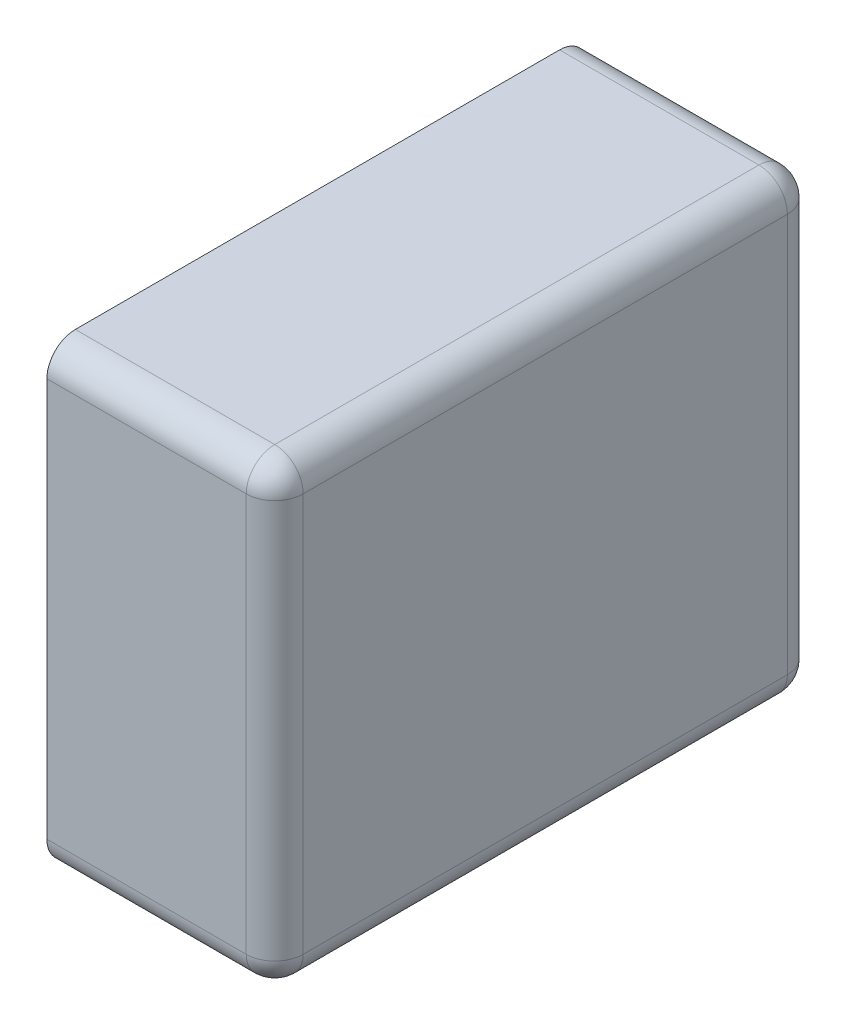
ISO-10303-21;
HEADER;
FILE_DESCRIPTION(('STEP AP214'),'2;1');
FILE_NAME('part.step','',(''),(''),'','','');
FILE_SCHEMA(('AUTOMOTIVE_DESIGN { 1 0 10303 214 1 1 1 1 }'));
ENDSEC;
DATA;
#1=APPLICATION_CONTEXT('core data for automotive mechanical design processes');
#2=APPLICATION_PROTOCOL_DEFINITION('international standard','automotive_design',2000,#1);
#3=PRODUCT_CONTEXT('',#1,'mechanical');
#4=PRODUCT('Part','Part','',(#3));
#5=PRODUCT_RELATED_PRODUCT_CATEGORY('part','',(#4));
#6=PRODUCT_DEFINITION_FORMATION('','',#4);
#7=PRODUCT_DEFINITION_CONTEXT('part definition',#1,'design');
#8=PRODUCT_DEFINITION('design','',#6,#7);
#9=PRODUCT_DEFINITION_SHAPE('','',#8);
#10=(LENGTH_UNIT() NAMED_UNIT(*) SI_UNIT(.MILLI.,.METRE.));
#11=(NAMED_UNIT(*) PLANE_ANGLE_UNIT() SI_UNIT($,.RADIAN.));
#12=(NAMED_UNIT(*) SI_UNIT($,.STERADIAN.) SOLID_ANGLE_UNIT());
#13=UNCERTAINTY_MEASURE_WITH_UNIT(LENGTH_MEASURE(1.E-05),#10,'distance_accuracy_value','');
#14=(GEOMETRIC_REPRESENTATION_CONTEXT(3) GLOBAL_UNCERTAINTY_ASSIGNED_CONTEXT((#13)) GLOBAL_UNIT_ASSIGNED_CONTEXT((#10,
#11,#12)) REPRESENTATION_CONTEXT('',''));
#15=CARTESIAN_POINT('',(0.,0.,0.));
#16=DIRECTION('',(0.,0.,1.));
#17=DIRECTION('',(1.,0.,0.));
#18=AXIS2_PLACEMENT_3D('',#15,#16,#17);
#19=CARTESIAN_POINT('',(0.1,0.491666689446,0.));
#20=DIRECTION('',(0.,0.,1.));
#21=DIRECTION('',(1.,0.,0.));
#22=AXIS2_PLACEMENT_3D('',#19,#20,#21);
#23=PLANE('',#22);
#24=DIRECTION('',(1.,0.,0.));
#25=VECTOR('',#24,1.);
#26=CARTESIAN_POINT('',(0.,0.141666689446,0.));
#27=LINE('',#26,#25);
#28=CARTESIAN_POINT('',(-0.1,0.141666689446,0.));
#29=VERTEX_POINT('',#28);
#30=CARTESIAN_POINT('',(0.25,0.141666689446,0.));
#31=VERTEX_POINT('',#30);
#32=EDGE_CURVE('E92',#29,#31,#27,.T.);
#33=ORIENTED_EDGE('',*,*,#32,.F.);
#34=DIRECTION('',(0.,1.,0.));
#35=VECTOR('',#34,1.);
#36=CARTESIAN_POINT('',(-0.1,0.09166668944581,0.));
#37=LINE('',#36,#35);
#38=CARTESIAN_POINT('',(-0.1,0.841666689446,0.));
#39=VERTEX_POINT('',#38);
#40=EDGE_CURVE('E11',#29,#39,#37,.T.);
#41=ORIENTED_EDGE('',*,*,#40,.T.);
#42=DIRECTION('',(-1.,0.,0.));
#43=VECTOR('',#42,1.);
#44=CARTESIAN_POINT('',(0.2,0.841666689446,0.));
#45=LINE('',#44,#43);
#46=CARTESIAN_POINT('',(0.25,0.841666689446,0.));
#47=VERTEX_POINT('',#46);
#48=EDGE_CURVE('E168',#47,#39,#45,.T.);
#49=ORIENTED_EDGE('',*,*,#48,.F.);
#50=DIRECTION('',(0.,1.,0.));
#51=VECTOR('',#50,1.);
#52=CARTESIAN_POINT('',(0.25,0.291666689446,0.));
#53=LINE('',#52,#51);
#54=EDGE_CURVE('E199',#31,#47,#53,.T.);
#55=ORIENTED_EDGE('',*,*,#54,.F.);
#56=EDGE_LOOP('',(#33,#41,#49,#55));
#57=FACE_BOUND('',#56,.T.);
#58=ADVANCED_FACE('F16',(#57),#23,.F.);
#59=CARTESIAN_POINT('',(0.3,0.891666689446,0.));
#60=DIRECTION('',(0.,1.,0.));
#61=DIRECTION('',(1.,0.,0.));
#62=AXIS2_PLACEMENT_3D('',#59,#60,#61);
#63=PLANE('',#62);
#64=DIRECTION('',(1.,0.,0.));
#65=VECTOR('',#64,1.);
#66=CARTESIAN_POINT('',(0.2,0.891666689446,0.05));
#67=LINE('',#66,#65);
#68=CARTESIAN_POINT('',(-0.1,0.891666689446,0.05));
#69=VERTEX_POINT('',#68);
#70=CARTESIAN_POINT('',(0.25,0.891666689446,0.05));
#71=VERTEX_POINT('',#70);
#72=EDGE_CURVE('E173',#69,#71,#67,.T.);
#73=ORIENTED_EDGE('',*,*,#72,.F.);
#74=DIRECTION('',(0.,0.,1.));
#75=VECTOR('',#74,1.);
#76=CARTESIAN_POINT('',(-0.1,0.891666689446,0.));
#77=LINE('',#76,#75);
#78=CARTESIAN_POINT('',(-0.1,0.891666689446,0.9));
#79=VERTEX_POINT('',#78);
#80=EDGE_CURVE('E27',#69,#79,#77,.T.);
#81=ORIENTED_EDGE('',*,*,#80,.T.);
#82=DIRECTION('',(-1.,0.,0.));
#83=VECTOR('',#82,1.);
#84=CARTESIAN_POINT('',(0.2,0.891666689446,0.9));
#85=LINE('',#84,#83);
#86=CARTESIAN_POINT('',(0.25,0.891666689446,0.9));
#87=VERTEX_POINT('',#86);
#88=EDGE_CURVE('E140',#87,#79,#85,.T.);
#89=ORIENTED_EDGE('',*,*,#88,.F.);
#90=DIRECTION('',(0.,0.,1.));
#91=VECTOR('',#90,1.);
#92=CARTESIAN_POINT('',(0.25,0.891666689446,0.));
#93=LINE('',#92,#91);
#94=EDGE_CURVE('E145',#71,#87,#93,.T.);
#95=ORIENTED_EDGE('',*,*,#94,.F.);
#96=EDGE_LOOP('',(#73,#81,#89,#95));
#97=FACE_BOUND('',#96,.T.);
#98=ADVANCED_FACE('F412',(#97),#63,.T.);
#99=CARTESIAN_POINT('',(-0.1,0.891666689446,0.));
#100=DIRECTION('',(-1.,0.,0.));
#101=DIRECTION('',(0.,1.,0.));
#102=AXIS2_PLACEMENT_3D('',#99,#100,#101);
#103=PLANE('',#102);
#104=CARTESIAN_POINT('',(-0.1,0.141666689446,0.05));
#105=DIRECTION('',(1.,0.,0.));
#106=DIRECTION('',(0.,-0.707106781186548,-0.707106781186548));
#107=AXIS2_PLACEMENT_3D('',#104,#105,#106);
#108=CIRCLE('',#107,0.05);
#109=CARTESIAN_POINT('',(-0.1,0.09166668944581,0.05));
#110=VERTEX_POINT('',#109);
#111=EDGE_CURVE('E164',#110,#29,#108,.T.);
#112=ORIENTED_EDGE('',*,*,#111,.F.);
#113=DIRECTION('',(0.,0.,1.));
#114=VECTOR('',#113,1.);
#115=CARTESIAN_POINT('',(-0.1,0.09166668944581,0.));
#116=LINE('',#115,#114);
#117=CARTESIAN_POINT('',(-0.1,0.09166668944581,0.9));
#118=VERTEX_POINT('',#117);
#119=EDGE_CURVE('E129',#110,#118,#116,.T.);
#120=ORIENTED_EDGE('',*,*,#119,.T.);
#121=CARTESIAN_POINT('',(-0.1,0.141666689446,0.9));
#122=DIRECTION('',(1.,0.,0.));
#123=DIRECTION('',(0.,-0.707106781186548,0.707106781186548));
#124=AXIS2_PLACEMENT_3D('',#121,#122,#123);
#125=CIRCLE('',#124,0.05);
#126=CARTESIAN_POINT('',(-0.1,0.141666689446,0.95));
#127=VERTEX_POINT('',#126);
#128=EDGE_CURVE('E125',#127,#118,#125,.T.);
#129=ORIENTED_EDGE('',*,*,#128,.F.);
#130=DIRECTION('',(0.,-1.,0.));
#131=VECTOR('',#130,1.);
#132=CARTESIAN_POINT('',(-0.1,0.09166668944581,0.95));
#133=LINE('',#132,#131);
#134=CARTESIAN_POINT('',(-0.1,0.841666689446,0.95));
#135=VERTEX_POINT('',#134);
#136=EDGE_CURVE('E119',#135,#127,#133,.T.);
#137=ORIENTED_EDGE('',*,*,#136,.F.);
#138=CARTESIAN_POINT('',(-0.1,0.841666689446,0.9));
#139=DIRECTION('',(1.,0.,0.));
#140=DIRECTION('',(0.,0.707106781186548,0.707106781186548));
#141=AXIS2_PLACEMENT_3D('',#138,#139,#140);
#142=CIRCLE('',#141,0.05);
#143=EDGE_CURVE('E123',#79,#135,#142,.T.);
#144=ORIENTED_EDGE('',*,*,#143,.F.);
#145=ORIENTED_EDGE('',*,*,#80,.F.);
#146=CARTESIAN_POINT('',(-0.1,0.841666689446,0.05));
#147=DIRECTION('',(1.,0.,0.));
#148=DIRECTION('',(0.,0.707106781186548,-0.707106781186548));
#149=AXIS2_PLACEMENT_3D('',#146,#147,#148);
#150=CIRCLE('',#149,0.05);
#151=EDGE_CURVE('E20',#39,#69,#150,.T.);
#152=ORIENTED_EDGE('',*,*,#151,.F.);
#153=ORIENTED_EDGE('',*,*,#40,.F.);
#154=EDGE_LOOP('',(#112,#120,#129,#137,#144,#145,#152,#153));
#155=FACE_BOUND('',#154,.T.);
#156=ADVANCED_FACE('F121',(#155),#103,.T.);
#157=CARTESIAN_POINT('',(0.3,0.09166668944581,0.));
#158=DIRECTION('',(1.,0.,0.));
#159=DIRECTION('',(0.,1.,0.));
#160=AXIS2_PLACEMENT_3D('',#157,#158,#159);
#161=PLANE('',#160);
#162=DIRECTION('',(0.,0.,-1.));
#163=VECTOR('',#162,1.);
#164=CARTESIAN_POINT('',(0.3,0.841666689446,0.));
#165=LINE('',#164,#163);
#166=CARTESIAN_POINT('',(0.3,0.841666689446,0.9));
#167=VERTEX_POINT('',#166);
#168=CARTESIAN_POINT('',(0.3,0.841666689446,0.05));
#169=VERTEX_POINT('',#168);
#170=EDGE_CURVE('E152',#167,#169,#165,.T.);
#171=ORIENTED_EDGE('',*,*,#170,.F.);
#172=DIRECTION('',(0.,1.,0.));
#173=VECTOR('',#172,1.);
#174=CARTESIAN_POINT('',(0.3,0.291666689446,0.9));
#175=LINE('',#174,#173);
#176=CARTESIAN_POINT('',(0.3,0.141666689446,0.9));
#177=VERTEX_POINT('',#176);
#178=EDGE_CURVE('E156',#177,#167,#175,.T.);
#179=ORIENTED_EDGE('',*,*,#178,.F.);
#180=DIRECTION('',(0.,0.,1.));
#181=VECTOR('',#180,1.);
#182=CARTESIAN_POINT('',(0.3,0.141666689446,0.));
#183=LINE('',#182,#181);
#184=CARTESIAN_POINT('',(0.3,0.141666689446,0.05));
#185=VERTEX_POINT('',#184);
#186=EDGE_CURVE('E189',#185,#177,#183,.T.);
#187=ORIENTED_EDGE('',*,*,#186,.F.);
#188=DIRECTION('',(0.,-1.,0.));
#189=VECTOR('',#188,1.);
#190=CARTESIAN_POINT('',(0.3,0.291666689446,0.05));
#191=LINE('',#190,#189);
#192=EDGE_CURVE('E80',#169,#185,#191,.T.);
#193=ORIENTED_EDGE('',*,*,#192,.F.);
#194=EDGE_LOOP('',(#171,#179,#187,#193));
#195=FACE_BOUND('',#194,.T.);
#196=ADVANCED_FACE('F230',(#195),#161,.T.);
#197=CARTESIAN_POINT('',(0.1,0.491666689446,0.95));
#198=DIRECTION('',(0.,0.,1.));
#199=DIRECTION('',(1.,0.,0.));
#200=AXIS2_PLACEMENT_3D('',#197,#198,#199);
#201=PLANE('',#200);
#202=DIRECTION('',(-1.,0.,0.));
#203=VECTOR('',#202,1.);
#204=CARTESIAN_POINT('',(0.,0.141666689446,0.95));
#205=LINE('',#204,#203);
#206=CARTESIAN_POINT('',(0.25,0.141666689446,0.95));
#207=VERTEX_POINT('',#206);
#208=EDGE_CURVE('E167',#207,#127,#205,.T.);
#209=ORIENTED_EDGE('',*,*,#208,.F.);
#210=DIRECTION('',(0.,-1.,0.));
#211=VECTOR('',#210,1.);
#212=CARTESIAN_POINT('',(0.25,0.291666689446,0.95));
#213=LINE('',#212,#211);
#214=CARTESIAN_POINT('',(0.25,0.841666689446,0.95));
#215=VERTEX_POINT('',#214);
#216=EDGE_CURVE('E135',#215,#207,#213,.T.);
#217=ORIENTED_EDGE('',*,*,#216,.F.);
#218=DIRECTION('',(1.,0.,0.));
#219=VECTOR('',#218,1.);
#220=CARTESIAN_POINT('',(0.2,0.841666689446,0.95));
#221=LINE('',#220,#219);
#222=EDGE_CURVE('E132',#135,#215,#221,.T.);
#223=ORIENTED_EDGE('',*,*,#222,.F.);
#224=ORIENTED_EDGE('',*,*,#136,.T.);
#225=EDGE_LOOP('',(#209,#217,#223,#224));
#226=FACE_BOUND('',#225,.T.);
#227=ADVANCED_FACE('F133',(#226),#201,.T.);
#228=CARTESIAN_POINT('',(-0.1,0.09166668944581,0.));
#229=DIRECTION('',(0.,-1.,0.));
#230=DIRECTION('',(0.,0.,-1.));
#231=AXIS2_PLACEMENT_3D('',#228,#229,#230);
#232=PLANE('',#231);
#233=DIRECTION('',(-1.,0.,0.));
#234=VECTOR('',#233,1.);
#235=CARTESIAN_POINT('',(0.,0.09166668944581,0.05));
#236=LINE('',#235,#234);
#237=CARTESIAN_POINT('',(0.25,0.09166668944581,0.05));
#238=VERTEX_POINT('',#237);
#239=EDGE_CURVE('E163',#238,#110,#236,.T.);
#240=ORIENTED_EDGE('',*,*,#239,.F.);
#241=DIRECTION('',(0.,0.,-1.));
#242=VECTOR('',#241,1.);
#243=CARTESIAN_POINT('',(0.25,0.09166668944581,0.));
#244=LINE('',#243,#242);
#245=CARTESIAN_POINT('',(0.25,0.09166668944581,0.9));
#246=VERTEX_POINT('',#245);
#247=EDGE_CURVE('E198',#246,#238,#244,.T.);
#248=ORIENTED_EDGE('',*,*,#247,.F.);
#249=DIRECTION('',(1.,0.,0.));
#250=VECTOR('',#249,1.);
#251=CARTESIAN_POINT('',(0.,0.09166668944581,0.9));
#252=LINE('',#251,#250);
#253=EDGE_CURVE('E160',#118,#246,#252,.T.);
#254=ORIENTED_EDGE('',*,*,#253,.F.);
#255=ORIENTED_EDGE('',*,*,#119,.F.);
#256=EDGE_LOOP('',(#240,#248,#254,#255));
#257=FACE_BOUND('',#256,.T.);
#258=ADVANCED_FACE('F356',(#257),#232,.T.);
#259=CARTESIAN_POINT('',(0.,0.141666689446,0.05));
#260=DIRECTION('',(-1.,0.,0.));
#261=DIRECTION('',(0.,-0.707106781186548,-0.707106781186548));
#262=AXIS2_PLACEMENT_3D('',#259,#260,#261);
#263=CYLINDRICAL_SURFACE('',#262,0.05);
#264=ORIENTED_EDGE('',*,*,#111,.T.);
#265=ORIENTED_EDGE('',*,*,#32,.T.);
#266=CARTESIAN_POINT('',(0.25,0.141666689446,0.05));
#267=DIRECTION('',(1.,0.,0.));
#268=DIRECTION('',(0.,0.,-1.));
#269=AXIS2_PLACEMENT_3D('',#266,#267,#268);
#270=CIRCLE('',#269,0.05);
#271=EDGE_CURVE('E268',#238,#31,#270,.T.);
#272=ORIENTED_EDGE('',*,*,#271,.F.);
#273=ORIENTED_EDGE('',*,*,#239,.T.);
#274=EDGE_LOOP('',(#264,#265,#272,#273));
#275=FACE_BOUND('',#274,.T.);
#276=ADVANCED_FACE('F368',(#275),#263,.T.);
#277=CARTESIAN_POINT('',(0.,0.141666689446,0.9));
#278=DIRECTION('',(1.,0.,0.));
#279=DIRECTION('',(0.,-0.707106781186548,0.707106781186548));
#280=AXIS2_PLACEMENT_3D('',#277,#278,#279);
#281=CYLINDRICAL_SURFACE('',#280,0.05);
#282=ORIENTED_EDGE('',*,*,#128,.T.);
#283=ORIENTED_EDGE('',*,*,#253,.T.);
#284=CARTESIAN_POINT('',(0.25,0.141666689446,0.9));
#285=DIRECTION('',(1.,0.,0.));
#286=DIRECTION('',(0.,-1.,0.));
#287=AXIS2_PLACEMENT_3D('',#284,#285,#286);
#288=CIRCLE('',#287,0.05);
#289=EDGE_CURVE('E178',#207,#246,#288,.T.);
#290=ORIENTED_EDGE('',*,*,#289,.F.);
#291=ORIENTED_EDGE('',*,*,#208,.T.);
#292=EDGE_LOOP('',(#282,#283,#290,#291));
#293=FACE_BOUND('',#292,.T.);
#294=ADVANCED_FACE('F362',(#293),#281,.T.);
#295=CARTESIAN_POINT('',(0.25,0.291666689446,0.05));
#296=DIRECTION('',(0.,-1.,0.));
#297=DIRECTION('',(0.707106781186548,0.,-0.707106781186548));
#298=AXIS2_PLACEMENT_3D('',#295,#296,#297);
#299=CYLINDRICAL_SURFACE('',#298,0.05);
#300=CARTESIAN_POINT('',(0.25,0.141666689446,0.05));
#301=DIRECTION('',(0.,-1.,0.));
#302=DIRECTION('',(1.,0.,0.));
#303=AXIS2_PLACEMENT_3D('',#300,#301,#302);
#304=CIRCLE('',#303,0.05);
#305=EDGE_CURVE('E179',#31,#185,#304,.T.);
#306=ORIENTED_EDGE('',*,*,#305,.F.);
#307=ORIENTED_EDGE('',*,*,#54,.T.);
#308=CARTESIAN_POINT('',(0.25,0.841666689446,0.05));
#309=DIRECTION('',(0.,1.,0.));
#310=DIRECTION('',(0.,0.,-1.));
#311=AXIS2_PLACEMENT_3D('',#308,#309,#310);
#312=CIRCLE('',#311,0.05);
#313=EDGE_CURVE('E184',#169,#47,#312,.T.);
#314=ORIENTED_EDGE('',*,*,#313,.F.);
#315=ORIENTED_EDGE('',*,*,#192,.T.);
#316=EDGE_LOOP('',(#306,#307,#314,#315));
#317=FACE_BOUND('',#316,.T.);
#318=ADVANCED_FACE('F367',(#317),#299,.T.);
#319=CARTESIAN_POINT('',(0.25,0.291666689446,0.9));
#320=DIRECTION('',(0.,1.,0.));
#321=DIRECTION('',(0.707106781186548,0.,0.707106781186548));
#322=AXIS2_PLACEMENT_3D('',#319,#320,#321);
#323=CYLINDRICAL_SURFACE('',#322,0.05);
#324=CARTESIAN_POINT('',(0.25,0.841666689446,0.9));
#325=DIRECTION('',(0.,1.,0.));
#326=DIRECTION('',(1.,0.,0.));
#327=AXIS2_PLACEMENT_3D('',#324,#325,#326);
#328=CIRCLE('',#327,0.05);
#329=EDGE_CURVE('E172',#215,#167,#328,.T.);
#330=ORIENTED_EDGE('',*,*,#329,.F.);
#331=ORIENTED_EDGE('',*,*,#216,.T.);
#332=CARTESIAN_POINT('',(0.25,0.141666689446,0.9));
#333=DIRECTION('',(0.,-1.,0.));
#334=DIRECTION('',(0.,0.,1.));
#335=AXIS2_PLACEMENT_3D('',#332,#333,#334);
#336=CIRCLE('',#335,0.05);
#337=EDGE_CURVE('E194',#177,#207,#336,.T.);
#338=ORIENTED_EDGE('',*,*,#337,.F.);
#339=ORIENTED_EDGE('',*,*,#178,.T.);
#340=EDGE_LOOP('',(#330,#331,#338,#339));
#341=FACE_BOUND('',#340,.T.);
#342=ADVANCED_FACE('F226',(#341),#323,.T.);
#343=CARTESIAN_POINT('',(0.2,0.841666689446,0.9));
#344=DIRECTION('',(-1.,0.,0.));
#345=DIRECTION('',(0.,0.707106781186548,0.707106781186548));
#346=AXIS2_PLACEMENT_3D('',#343,#344,#345);
#347=CYLINDRICAL_SURFACE('',#346,0.05);
#348=ORIENTED_EDGE('',*,*,#143,.T.);
#349=ORIENTED_EDGE('',*,*,#222,.T.);
#350=CARTESIAN_POINT('',(0.25,0.841666689446,0.9));
#351=DIRECTION('',(1.,0.,0.));
#352=DIRECTION('',(0.,0.,1.));
#353=AXIS2_PLACEMENT_3D('',#350,#351,#352);
#354=CIRCLE('',#353,0.05);
#355=EDGE_CURVE('E202',#87,#215,#354,.T.);
#356=ORIENTED_EDGE('',*,*,#355,.F.);
#357=ORIENTED_EDGE('',*,*,#88,.T.);
#358=EDGE_LOOP('',(#348,#349,#356,#357));
#359=FACE_BOUND('',#358,.T.);
#360=ADVANCED_FACE('F143',(#359),#347,.T.);
#361=CARTESIAN_POINT('',(0.25,0.841666689446,0.));
#362=DIRECTION('',(0.,0.,1.));
#363=DIRECTION('',(0.707106781186548,0.707106781186548,0.));
#364=AXIS2_PLACEMENT_3D('',#361,#362,#363);
#365=CYLINDRICAL_SURFACE('',#364,0.05);
#366=CARTESIAN_POINT('',(0.25,0.841666689446,0.9));
#367=DIRECTION('',(0.,0.,1.));
#368=DIRECTION('',(0.,1.,0.));
#369=AXIS2_PLACEMENT_3D('',#366,#367,#368);
#370=CIRCLE('',#369,0.05);
#371=EDGE_CURVE('E183',#167,#87,#370,.T.);
#372=ORIENTED_EDGE('',*,*,#371,.F.);
#373=ORIENTED_EDGE('',*,*,#170,.T.);
#374=CARTESIAN_POINT('',(0.25,0.841666689446,0.05));
#375=DIRECTION('',(0.,0.,-1.));
#376=DIRECTION('',(1.,0.,0.));
#377=AXIS2_PLACEMENT_3D('',#374,#375,#376);
#378=CIRCLE('',#377,0.05);
#379=EDGE_CURVE('E239',#71,#169,#378,.T.);
#380=ORIENTED_EDGE('',*,*,#379,.F.);
#381=ORIENTED_EDGE('',*,*,#94,.T.);
#382=EDGE_LOOP('',(#372,#373,#380,#381));
#383=FACE_BOUND('',#382,.T.);
#384=ADVANCED_FACE('F216',(#383),#365,.T.);
#385=CARTESIAN_POINT('',(0.25,0.841666689446,0.9));
#386=DIRECTION('',(0.408248290463863,-0.816496580927726,0.408248290463863));
#387=DIRECTION('',(0.577350269189626,0.577350269189626,0.577350269189626));
#388=AXIS2_PLACEMENT_3D('',#385,#386,#387);
#389=SPHERICAL_SURFACE('',#388,0.05);
#390=ORIENTED_EDGE('',*,*,#329,.T.);
#391=ORIENTED_EDGE('',*,*,#371,.T.);
#392=ORIENTED_EDGE('',*,*,#355,.T.);
#393=EDGE_LOOP('',(#390,#391,#392));
#394=FACE_BOUND('',#393,.T.);
#395=ADVANCED_FACE('F212',(#394),#389,.T.);
#396=CARTESIAN_POINT('',(0.2,0.841666689446,0.05));
#397=DIRECTION('',(1.,0.,0.));
#398=DIRECTION('',(0.,0.707106781186548,-0.707106781186548));
#399=AXIS2_PLACEMENT_3D('',#396,#397,#398);
#400=CYLINDRICAL_SURFACE('',#399,0.05);
#401=ORIENTED_EDGE('',*,*,#151,.T.);
#402=ORIENTED_EDGE('',*,*,#72,.T.);
#403=CARTESIAN_POINT('',(0.25,0.841666689446,0.05));
#404=DIRECTION('',(1.,0.,0.));
#405=DIRECTION('',(0.,1.,0.));
#406=AXIS2_PLACEMENT_3D('',#403,#404,#405);
#407=CIRCLE('',#406,0.05);
#408=EDGE_CURVE('E188',#47,#71,#407,.T.);
#409=ORIENTED_EDGE('',*,*,#408,.F.);
#410=ORIENTED_EDGE('',*,*,#48,.T.);
#411=EDGE_LOOP('',(#401,#402,#409,#410));
#412=FACE_BOUND('',#411,.T.);
#413=ADVANCED_FACE('F18',(#412),#400,.T.);
#414=CARTESIAN_POINT('',(0.25,0.841666689446,0.05));
#415=DIRECTION('',(-0.816496580927726,0.408248290463863,-0.408248290463863));
#416=DIRECTION('',(0.577350269189626,0.577350269189626,-0.577350269189626));
#417=AXIS2_PLACEMENT_3D('',#414,#415,#416);
#418=SPHERICAL_SURFACE('',#417,0.05);
#419=ORIENTED_EDGE('',*,*,#313,.T.);
#420=ORIENTED_EDGE('',*,*,#408,.T.);
#421=ORIENTED_EDGE('',*,*,#379,.T.);
#422=EDGE_LOOP('',(#419,#420,#421));
#423=FACE_BOUND('',#422,.T.);
#424=ADVANCED_FACE('F450',(#423),#418,.T.);
#425=CARTESIAN_POINT('',(0.25,0.141666689446,0.));
#426=DIRECTION('',(0.,0.,1.));
#427=DIRECTION('',(0.707106781186548,-0.707106781186548,0.));
#428=AXIS2_PLACEMENT_3D('',#425,#426,#427);
#429=CYLINDRICAL_SURFACE('',#428,0.05);
#430=CARTESIAN_POINT('',(0.25,0.141666689446,0.9));
#431=DIRECTION('',(0.,0.,1.));
#432=DIRECTION('',(1.,0.,0.));
#433=AXIS2_PLACEMENT_3D('',#430,#431,#432);
#434=CIRCLE('',#433,0.05);
#435=EDGE_CURVE('E190',#246,#177,#434,.T.);
#436=ORIENTED_EDGE('',*,*,#435,.F.);
#437=ORIENTED_EDGE('',*,*,#247,.T.);
#438=CARTESIAN_POINT('',(0.25,0.141666689446,0.05));
#439=DIRECTION('',(0.,0.,-1.));
#440=DIRECTION('',(0.,-1.,0.));
#441=AXIS2_PLACEMENT_3D('',#438,#439,#440);
#442=CIRCLE('',#441,0.05);
#443=EDGE_CURVE('E174',#185,#238,#442,.T.);
#444=ORIENTED_EDGE('',*,*,#443,.F.);
#445=ORIENTED_EDGE('',*,*,#186,.T.);
#446=EDGE_LOOP('',(#436,#437,#444,#445));
#447=FACE_BOUND('',#446,.T.);
#448=ADVANCED_FACE('F445',(#447),#429,.T.);
#449=CARTESIAN_POINT('',(0.25,0.141666689446,0.9));
#450=DIRECTION('',(-0.408248290463863,-0.816496580927726,-0.408248290463863));
#451=DIRECTION('',(0.577350269189626,-0.577350269189626,0.577350269189626));
#452=AXIS2_PLACEMENT_3D('',#449,#450,#451);
#453=SPHERICAL_SURFACE('',#452,0.05);
#454=ORIENTED_EDGE('',*,*,#289,.T.);
#455=ORIENTED_EDGE('',*,*,#435,.T.);
#456=ORIENTED_EDGE('',*,*,#337,.T.);
#457=EDGE_LOOP('',(#454,#455,#456));
#458=FACE_BOUND('',#457,.T.);
#459=ADVANCED_FACE('F388',(#458),#453,.T.);
#460=CARTESIAN_POINT('',(0.25,0.141666689446,0.05));
#461=DIRECTION('',(-0.408248290463863,-0.816496580927726,0.408248290463863));
#462=DIRECTION('',(0.577350269189626,-0.577350269189626,-0.577350269189626));
#463=AXIS2_PLACEMENT_3D('',#460,#461,#462);
#464=SPHERICAL_SURFACE('',#463,0.05);
#465=ORIENTED_EDGE('',*,*,#271,.T.);
#466=ORIENTED_EDGE('',*,*,#305,.T.);
#467=ORIENTED_EDGE('',*,*,#443,.T.);
#468=EDGE_LOOP('',(#465,#466,#467));
#469=FACE_BOUND('',#468,.T.);
#470=ADVANCED_FACE('F384',(#469),#464,.T.);
#471=CLOSED_SHELL('',(#58,#98,#156,#196,#227,#258,#276,#294,#318,#342,#360,#384,#395,#413,#424,
#448,#459,#470));
#472=MANIFOLD_SOLID_BREP('B1',#471);
#473=ADVANCED_BREP_SHAPE_REPRESENTATION('',(#18,#472),#14);
#474=SHAPE_DEFINITION_REPRESENTATION(#9,#473);
ENDSEC;
END-ISO-10303-21;
